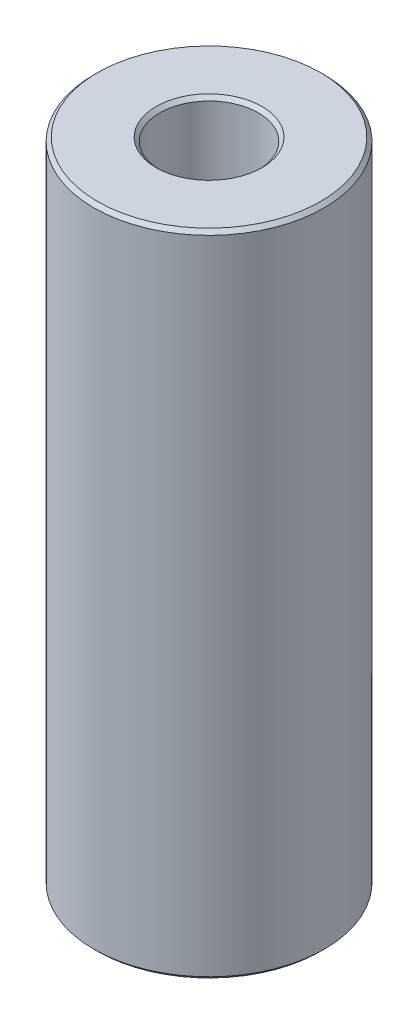
ISO-10303-21;
HEADER;
FILE_DESCRIPTION(('STEP AP214'),'2;1');
FILE_NAME('part.step','',(''),(''),'','','');
FILE_SCHEMA(('AUTOMOTIVE_DESIGN { 1 0 10303 214 1 1 1 1 }'));
ENDSEC;
DATA;
#1=APPLICATION_CONTEXT('core data for automotive mechanical design processes');
#2=APPLICATION_PROTOCOL_DEFINITION('international standard','automotive_design',2000,#1);
#3=PRODUCT_CONTEXT('',#1,'mechanical');
#4=PRODUCT('Part','Part','',(#3));
#5=PRODUCT_RELATED_PRODUCT_CATEGORY('part','',(#4));
#6=PRODUCT_DEFINITION_FORMATION('','',#4);
#7=PRODUCT_DEFINITION_CONTEXT('part definition',#1,'design');
#8=PRODUCT_DEFINITION('design','',#6,#7);
#9=PRODUCT_DEFINITION_SHAPE('','',#8);
#10=(LENGTH_UNIT() NAMED_UNIT(*) SI_UNIT(.MILLI.,.METRE.));
#11=(NAMED_UNIT(*) PLANE_ANGLE_UNIT() SI_UNIT($,.RADIAN.));
#12=(NAMED_UNIT(*) SI_UNIT($,.STERADIAN.) SOLID_ANGLE_UNIT());
#13=UNCERTAINTY_MEASURE_WITH_UNIT(LENGTH_MEASURE(1.E-05),#10,'distance_accuracy_value','');
#14=(GEOMETRIC_REPRESENTATION_CONTEXT(3) GLOBAL_UNCERTAINTY_ASSIGNED_CONTEXT((#13)) GLOBAL_UNIT_ASSIGNED_CONTEXT((#10,
#11,#12)) REPRESENTATION_CONTEXT('',''));
#15=CARTESIAN_POINT('',(0.,0.,0.));
#16=DIRECTION('',(0.,0.,1.));
#17=DIRECTION('',(1.,0.,0.));
#18=AXIS2_PLACEMENT_3D('',#15,#16,#17);
#19=CARTESIAN_POINT('',(0.,225.426912369639,0.));
#20=DIRECTION('',(0.,-1.,0.));
#21=DIRECTION('',(0.,0.,-1.));
#22=AXIS2_PLACEMENT_3D('',#19,#20,#21);
#23=CYLINDRICAL_SURFACE('',#22,40.);
#24=CARTESIAN_POINT('',(0.,1.26723502285533,0.));
#25=DIRECTION('',(0.,1.,0.));
#26=DIRECTION('',(0.,0.,1.));
#27=AXIS2_PLACEMENT_3D('',#24,#25,#26);
#28=CIRCLE('',#27,40.);
#29=CARTESIAN_POINT('',(0.,1.26723502285533,40.));
#30=VERTEX_POINT('',#29);
#31=EDGE_CURVE('E10',#30,#30,#28,.T.);
#32=ORIENTED_EDGE('',*,*,#31,.T.);
#33=EDGE_LOOP('',(#32));
#34=FACE_BOUND('',#33,.T.);
#35=CARTESIAN_POINT('',(0.,224.159677346783,0.));
#36=DIRECTION('',(0.,1.,0.));
#37=DIRECTION('',(0.,0.,1.));
#38=AXIS2_PLACEMENT_3D('',#35,#36,#37);
#39=CIRCLE('',#38,40.);
#40=CARTESIAN_POINT('',(0.,224.159677346783,40.));
#41=VERTEX_POINT('',#40);
#42=EDGE_CURVE('E50',#41,#41,#39,.F.);
#43=ORIENTED_EDGE('',*,*,#42,.T.);
#44=EDGE_LOOP('',(#43));
#45=FACE_BOUND('',#44,.T.);
#46=ADVANCED_FACE('F39',(#34,#45),#23,.T.);
#47=CARTESIAN_POINT('',(0.,225.426912369639,0.));
#48=DIRECTION('',(0.,1.,0.));
#49=DIRECTION('',(0.,0.,1.));
#50=AXIS2_PLACEMENT_3D('',#47,#48,#49);
#51=PLANE('',#50);
#52=CARTESIAN_POINT('',(0.,225.426912369639,0.));
#53=DIRECTION('',(0.,1.,0.));
#54=DIRECTION('',(0.,0.,1.));
#55=AXIS2_PLACEMENT_3D('',#52,#53,#54);
#56=CIRCLE('',#55,18.3979370352418);
#57=CARTESIAN_POINT('',(0.,225.426912369639,18.3979370352418));
#58=VERTEX_POINT('',#57);
#59=EDGE_CURVE('E58',#58,#58,#56,.F.);
#60=ORIENTED_EDGE('',*,*,#59,.T.);
#61=EDGE_LOOP('',(#60));
#62=FACE_BOUND('',#61,.T.);
#63=CARTESIAN_POINT('',(0.,225.426912369639,0.));
#64=DIRECTION('',(0.,1.,0.));
#65=DIRECTION('',(0.,0.,1.));
#66=AXIS2_PLACEMENT_3D('',#63,#64,#65);
#67=CIRCLE('',#66,38.7327649771447);
#68=CARTESIAN_POINT('',(0.,225.426912369639,38.7327649771447));
#69=VERTEX_POINT('',#68);
#70=EDGE_CURVE('E61',#69,#69,#67,.T.);
#71=ORIENTED_EDGE('',*,*,#70,.T.);
#72=EDGE_LOOP('',(#71));
#73=FACE_BOUND('',#72,.T.);
#74=ADVANCED_FACE('F88',(#62,#73),#51,.T.);
#75=CARTESIAN_POINT('',(0.,0.,0.));
#76=DIRECTION('',(0.,1.,0.));
#77=DIRECTION('',(0.,0.,1.));
#78=AXIS2_PLACEMENT_3D('',#75,#76,#77);
#79=PLANE('',#78);
#80=CARTESIAN_POINT('',(0.,0.,0.));
#81=DIRECTION('',(0.,1.,0.));
#82=DIRECTION('',(0.,0.,1.));
#83=AXIS2_PLACEMENT_3D('',#80,#81,#82);
#84=CIRCLE('',#83,18.3979370352418);
#85=CARTESIAN_POINT('',(0.,0.,18.3979370352418));
#86=VERTEX_POINT('',#85);
#87=EDGE_CURVE('E51',#86,#86,#84,.T.);
#88=ORIENTED_EDGE('',*,*,#87,.T.);
#89=EDGE_LOOP('',(#88));
#90=FACE_BOUND('',#89,.T.);
#91=CARTESIAN_POINT('',(0.,0.,0.));
#92=DIRECTION('',(0.,1.,0.));
#93=DIRECTION('',(0.,0.,1.));
#94=AXIS2_PLACEMENT_3D('',#91,#92,#93);
#95=CIRCLE('',#94,38.7327649771447);
#96=CARTESIAN_POINT('',(0.,0.,38.7327649771447));
#97=VERTEX_POINT('',#96);
#98=EDGE_CURVE('E54',#97,#97,#95,.F.);
#99=ORIENTED_EDGE('',*,*,#98,.T.);
#100=EDGE_LOOP('',(#99));
#101=FACE_BOUND('',#100,.T.);
#102=ADVANCED_FACE('F83',(#90,#101),#79,.F.);
#103=CARTESIAN_POINT('',(0.,225.426912369639,0.));
#104=DIRECTION('',(0.,-1.,0.));
#105=DIRECTION('',(0.,0.,-1.));
#106=AXIS2_PLACEMENT_3D('',#103,#104,#105);
#107=CYLINDRICAL_SURFACE('',#106,17.1307020123865);
#108=CARTESIAN_POINT('',(0.,224.159677346783,0.));
#109=DIRECTION('',(0.,1.,0.));
#110=DIRECTION('',(0.,0.,1.));
#111=AXIS2_PLACEMENT_3D('',#108,#109,#110);
#112=CIRCLE('',#111,17.1307020123865);
#113=CARTESIAN_POINT('',(0.,224.159677346783,17.1307020123865));
#114=VERTEX_POINT('',#113);
#115=EDGE_CURVE('E67',#114,#114,#112,.T.);
#116=ORIENTED_EDGE('',*,*,#115,.T.);
#117=EDGE_LOOP('',(#116));
#118=FACE_BOUND('',#117,.T.);
#119=CARTESIAN_POINT('',(0.,1.26723502285536,0.));
#120=DIRECTION('',(0.,1.,0.));
#121=DIRECTION('',(0.,0.,1.));
#122=AXIS2_PLACEMENT_3D('',#119,#120,#121);
#123=CIRCLE('',#122,17.1307020123865);
#124=CARTESIAN_POINT('',(0.,1.26723502285536,17.1307020123865));
#125=VERTEX_POINT('',#124);
#126=EDGE_CURVE('E69',#125,#125,#123,.F.);
#127=ORIENTED_EDGE('',*,*,#126,.T.);
#128=EDGE_LOOP('',(#127));
#129=FACE_BOUND('',#128,.T.);
#130=ADVANCED_FACE('F71',(#118,#129),#107,.F.);
#131=CARTESIAN_POINT('',(0.,224.159677346783,0.));
#132=DIRECTION('',(0.,1.,0.));
#133=DIRECTION('',(0.,0.,1.));
#134=AXIS2_PLACEMENT_3D('',#131,#132,#133);
#135=CONICAL_SURFACE('',#134,17.1307020123865,0.78539816339745);
#136=ORIENTED_EDGE('',*,*,#59,.F.);
#137=EDGE_LOOP('',(#136));
#138=FACE_BOUND('',#137,.T.);
#139=ORIENTED_EDGE('',*,*,#115,.F.);
#140=EDGE_LOOP('',(#139));
#141=FACE_BOUND('',#140,.T.);
#142=ADVANCED_FACE('F77',(#138,#141),#135,.F.);
#143=CARTESIAN_POINT('',(0.,0.,0.));
#144=DIRECTION('',(0.,-1.,0.));
#145=DIRECTION('',(0.,0.,-1.));
#146=AXIS2_PLACEMENT_3D('',#143,#144,#145);
#147=CONICAL_SURFACE('',#146,18.3979370352418,0.78539816339745);
#148=ORIENTED_EDGE('',*,*,#126,.F.);
#149=EDGE_LOOP('',(#148));
#150=FACE_BOUND('',#149,.T.);
#151=ORIENTED_EDGE('',*,*,#87,.F.);
#152=EDGE_LOOP('',(#151));
#153=FACE_BOUND('',#152,.T.);
#154=ADVANCED_FACE('F73',(#150,#153),#147,.F.);
#155=CARTESIAN_POINT('',(0.,1.26723502285533,0.));
#156=DIRECTION('',(0.,1.,0.));
#157=DIRECTION('',(0.,0.,1.));
#158=AXIS2_PLACEMENT_3D('',#155,#156,#157);
#159=CONICAL_SURFACE('',#158,40.,0.785398163397435);
#160=ORIENTED_EDGE('',*,*,#98,.F.);
#161=EDGE_LOOP('',(#160));
#162=FACE_BOUND('',#161,.T.);
#163=ORIENTED_EDGE('',*,*,#31,.F.);
#164=EDGE_LOOP('',(#163));
#165=FACE_BOUND('',#164,.T.);
#166=ADVANCED_FACE('F76',(#162,#165),#159,.T.);
#167=CARTESIAN_POINT('',(0.,225.426912369639,0.));
#168=DIRECTION('',(0.,-1.,0.));
#169=DIRECTION('',(0.,0.,-1.));
#170=AXIS2_PLACEMENT_3D('',#167,#168,#169);
#171=CONICAL_SURFACE('',#170,38.7327649771447,0.785398163397456);
#172=ORIENTED_EDGE('',*,*,#42,.F.);
#173=EDGE_LOOP('',(#172));
#174=FACE_BOUND('',#173,.T.);
#175=ORIENTED_EDGE('',*,*,#70,.F.);
#176=EDGE_LOOP('',(#175));
#177=FACE_BOUND('',#176,.T.);
#178=ADVANCED_FACE('F45',(#174,#177),#171,.T.);
#179=CLOSED_SHELL('',(#46,#74,#102,#130,#142,#154,#166,#178));
#180=MANIFOLD_SOLID_BREP('B2',#179);
#181=ADVANCED_BREP_SHAPE_REPRESENTATION('',(#18,#180),#14);
#182=SHAPE_DEFINITION_REPRESENTATION(#9,#181);
ENDSEC;
END-ISO-10303-21;
